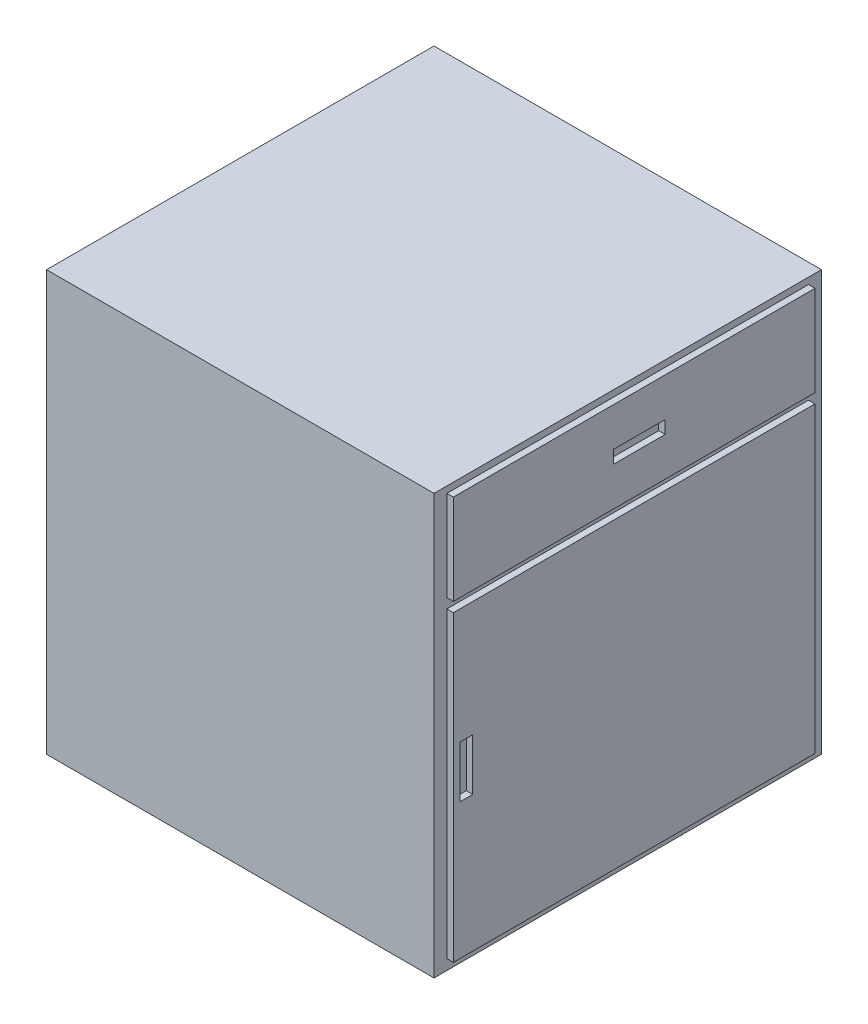
ISO-10303-21;
HEADER;
FILE_DESCRIPTION(('STEP AP214'),'2;1');
FILE_NAME('part.step','',(''),(''),'','','');
FILE_SCHEMA(('AUTOMOTIVE_DESIGN { 1 0 10303 214 1 1 1 1 }'));
ENDSEC;
DATA;
#1=APPLICATION_CONTEXT('core data for automotive mechanical design processes');
#2=APPLICATION_PROTOCOL_DEFINITION('international standard','automotive_design',2000,#1);
#3=PRODUCT_CONTEXT('',#1,'mechanical');
#4=PRODUCT('Part','Part','',(#3));
#5=PRODUCT_RELATED_PRODUCT_CATEGORY('part','',(#4));
#6=PRODUCT_DEFINITION_FORMATION('','',#4);
#7=PRODUCT_DEFINITION_CONTEXT('part definition',#1,'design');
#8=PRODUCT_DEFINITION('design','',#6,#7);
#9=PRODUCT_DEFINITION_SHAPE('','',#8);
#10=(LENGTH_UNIT() NAMED_UNIT(*) SI_UNIT(.MILLI.,.METRE.));
#11=(NAMED_UNIT(*) PLANE_ANGLE_UNIT() SI_UNIT($,.RADIAN.));
#12=(NAMED_UNIT(*) SI_UNIT($,.STERADIAN.) SOLID_ANGLE_UNIT());
#13=UNCERTAINTY_MEASURE_WITH_UNIT(LENGTH_MEASURE(1.E-05),#10,'distance_accuracy_value','');
#14=(GEOMETRIC_REPRESENTATION_CONTEXT(3) GLOBAL_UNCERTAINTY_ASSIGNED_CONTEXT((#13)) GLOBAL_UNIT_ASSIGNED_CONTEXT((#10,
#11,#12)) REPRESENTATION_CONTEXT('',''));
#15=CARTESIAN_POINT('',(0.,0.,0.));
#16=DIRECTION('',(0.,0.,1.));
#17=DIRECTION('',(1.,0.,0.));
#18=AXIS2_PLACEMENT_3D('',#15,#16,#17);
#19=CARTESIAN_POINT('',(0.,0.,600.));
#20=DIRECTION('',(-1.,0.,0.));
#21=DIRECTION('',(0.,-1.,0.));
#22=AXIS2_PLACEMENT_3D('',#19,#20,#21);
#23=PLANE('',#22);
#24=DIRECTION('',(0.,1.,0.));
#25=VECTOR('',#24,1.);
#26=CARTESIAN_POINT('',(0.,0.,0.));
#27=LINE('',#26,#25);
#28=CARTESIAN_POINT('',(0.,-650.,0.));
#29=VERTEX_POINT('',#28);
#30=CARTESIAN_POINT('',(0.,0.,0.));
#31=VERTEX_POINT('',#30);
#32=EDGE_CURVE('E304',#29,#31,#27,.T.);
#33=ORIENTED_EDGE('',*,*,#32,.T.);
#34=DIRECTION('',(0.,0.,-1.));
#35=VECTOR('',#34,1.);
#36=CARTESIAN_POINT('',(0.,0.,600.));
#37=LINE('',#36,#35);
#38=CARTESIAN_POINT('',(0.,0.,600.));
#39=VERTEX_POINT('',#38);
#40=EDGE_CURVE('E11',#39,#31,#37,.T.);
#41=ORIENTED_EDGE('',*,*,#40,.F.);
#42=DIRECTION('',(0.,1.,0.));
#43=VECTOR('',#42,1.);
#44=CARTESIAN_POINT('',(0.,0.,600.));
#45=LINE('',#44,#43);
#46=CARTESIAN_POINT('',(0.,-650.,600.));
#47=VERTEX_POINT('',#46);
#48=EDGE_CURVE('E305',#47,#39,#45,.T.);
#49=ORIENTED_EDGE('',*,*,#48,.F.);
#50=DIRECTION('',(0.,0.,-1.));
#51=VECTOR('',#50,1.);
#52=CARTESIAN_POINT('',(0.,-650.,600.));
#53=LINE('',#52,#51);
#54=EDGE_CURVE('E315',#47,#29,#53,.T.);
#55=ORIENTED_EDGE('',*,*,#54,.T.);
#56=EDGE_LOOP('',(#33,#41,#49,#55));
#57=FACE_BOUND('',#56,.T.);
#58=DIRECTION('',(0.,-1.,0.));
#59=VECTOR('',#58,1.);
#60=CARTESIAN_POINT('',(0.,-9.99660470248492,580.));
#61=LINE('',#60,#59);
#62=CARTESIAN_POINT('',(0.,-9.99660470248492,580.));
#63=VERTEX_POINT('',#62);
#64=CARTESIAN_POINT('',(0.,-149.996604702485,580.));
#65=VERTEX_POINT('',#64);
#66=EDGE_CURVE('E271',#63,#65,#61,.T.);
#67=ORIENTED_EDGE('',*,*,#66,.F.);
#68=DIRECTION('',(0.,0.,1.));
#69=VECTOR('',#68,1.);
#70=CARTESIAN_POINT('',(0.,-9.99660470248492,580.));
#71=LINE('',#70,#69);
#72=CARTESIAN_POINT('',(0.,-9.99660470248492,20.));
#73=VERTEX_POINT('',#72);
#74=EDGE_CURVE('E276',#73,#63,#71,.T.);
#75=ORIENTED_EDGE('',*,*,#74,.F.);
#76=DIRECTION('',(0.,1.,0.));
#77=VECTOR('',#76,1.);
#78=CARTESIAN_POINT('',(0.,-9.99660470248492,20.));
#79=LINE('',#78,#77);
#80=CARTESIAN_POINT('',(0.,-149.996604702485,20.));
#81=VERTEX_POINT('',#80);
#82=EDGE_CURVE('E288',#81,#73,#79,.T.);
#83=ORIENTED_EDGE('',*,*,#82,.F.);
#84=DIRECTION('',(0.,0.,-1.));
#85=VECTOR('',#84,1.);
#86=CARTESIAN_POINT('',(0.,-149.996604702485,580.));
#87=LINE('',#86,#85);
#88=EDGE_CURVE('E285',#65,#81,#87,.T.);
#89=ORIENTED_EDGE('',*,*,#88,.F.);
#90=EDGE_LOOP('',(#67,#75,#83,#89));
#91=FACE_BOUND('',#90,.T.);
#92=DIRECTION('',(0.,-1.,0.));
#93=VECTOR('',#92,1.);
#94=CARTESIAN_POINT('',(0.,-164.996604702485,580.));
#95=LINE('',#94,#93);
#96=CARTESIAN_POINT('',(0.,-164.996604702485,580.));
#97=VERTEX_POINT('',#96);
#98=CARTESIAN_POINT('',(0.,-633.972073677954,580.));
#99=VERTEX_POINT('',#98);
#100=EDGE_CURVE('E190',#97,#99,#95,.T.);
#101=ORIENTED_EDGE('',*,*,#100,.F.);
#102=DIRECTION('',(0.,0.,1.));
#103=VECTOR('',#102,1.);
#104=CARTESIAN_POINT('',(0.,-164.996604702485,580.));
#105=LINE('',#104,#103);
#106=CARTESIAN_POINT('',(0.,-164.996604702485,20.));
#107=VERTEX_POINT('',#106);
#108=EDGE_CURVE('E218',#107,#97,#105,.T.);
#109=ORIENTED_EDGE('',*,*,#108,.F.);
#110=DIRECTION('',(0.,1.,0.));
#111=VECTOR('',#110,1.);
#112=CARTESIAN_POINT('',(0.,-164.996604702485,20.));
#113=LINE('',#112,#111);
#114=CARTESIAN_POINT('',(0.,-633.972073677954,19.9999999999999));
#115=VERTEX_POINT('',#114);
#116=EDGE_CURVE('E56',#115,#107,#113,.T.);
#117=ORIENTED_EDGE('',*,*,#116,.F.);
#118=DIRECTION('',(0.,0.,-1.));
#119=VECTOR('',#118,1.);
#120=CARTESIAN_POINT('',(0.,-633.972073677954,580.));
#121=LINE('',#120,#119);
#122=EDGE_CURVE('E51',#99,#115,#121,.T.);
#123=ORIENTED_EDGE('',*,*,#122,.F.);
#124=EDGE_LOOP('',(#101,#109,#117,#123));
#125=FACE_BOUND('',#124,.T.);
#126=ADVANCED_FACE('F36',(#57,#91,#125),#23,.F.);
#127=CARTESIAN_POINT('',(0.,0.,600.));
#128=DIRECTION('',(0.,-1.,0.));
#129=DIRECTION('',(1.,0.,0.));
#130=AXIS2_PLACEMENT_3D('',#127,#128,#129);
#131=PLANE('',#130);
#132=DIRECTION('',(-1.,0.,0.));
#133=VECTOR('',#132,1.);
#134=CARTESIAN_POINT('',(0.,0.,0.));
#135=LINE('',#134,#133);
#136=CARTESIAN_POINT('',(-600.,0.,0.));
#137=VERTEX_POINT('',#136);
#138=EDGE_CURVE('E318',#31,#137,#135,.T.);
#139=ORIENTED_EDGE('',*,*,#138,.T.);
#140=DIRECTION('',(0.,0.,-1.));
#141=VECTOR('',#140,1.);
#142=CARTESIAN_POINT('',(-600.,0.,600.));
#143=LINE('',#142,#141);
#144=CARTESIAN_POINT('',(-600.,0.,600.));
#145=VERTEX_POINT('',#144);
#146=EDGE_CURVE('E44',#145,#137,#143,.T.);
#147=ORIENTED_EDGE('',*,*,#146,.F.);
#148=DIRECTION('',(-1.,0.,0.));
#149=VECTOR('',#148,1.);
#150=CARTESIAN_POINT('',(0.,0.,600.));
#151=LINE('',#150,#149);
#152=EDGE_CURVE('E308',#39,#145,#151,.T.);
#153=ORIENTED_EDGE('',*,*,#152,.F.);
#154=ORIENTED_EDGE('',*,*,#40,.T.);
#155=EDGE_LOOP('',(#139,#147,#153,#154));
#156=FACE_BOUND('',#155,.T.);
#157=ADVANCED_FACE('F349',(#156),#131,.F.);
#158=CARTESIAN_POINT('',(-600.,0.,600.));
#159=DIRECTION('',(1.,0.,0.));
#160=DIRECTION('',(0.,0.,-1.));
#161=AXIS2_PLACEMENT_3D('',#158,#159,#160);
#162=PLANE('',#161);
#163=DIRECTION('',(0.,-1.,0.));
#164=VECTOR('',#163,1.);
#165=CARTESIAN_POINT('',(-600.,0.,0.));
#166=LINE('',#165,#164);
#167=CARTESIAN_POINT('',(-600.,-650.,0.));
#168=VERTEX_POINT('',#167);
#169=EDGE_CURVE('E320',#137,#168,#166,.T.);
#170=ORIENTED_EDGE('',*,*,#169,.T.);
#171=DIRECTION('',(0.,0.,-1.));
#172=VECTOR('',#171,1.);
#173=CARTESIAN_POINT('',(-600.,-650.,600.));
#174=LINE('',#173,#172);
#175=CARTESIAN_POINT('',(-600.,-650.,600.));
#176=VERTEX_POINT('',#175);
#177=EDGE_CURVE('E325',#176,#168,#174,.T.);
#178=ORIENTED_EDGE('',*,*,#177,.F.);
#179=DIRECTION('',(0.,-1.,0.));
#180=VECTOR('',#179,1.);
#181=CARTESIAN_POINT('',(-600.,0.,600.));
#182=LINE('',#181,#180);
#183=EDGE_CURVE('E311',#145,#176,#182,.T.);
#184=ORIENTED_EDGE('',*,*,#183,.F.);
#185=ORIENTED_EDGE('',*,*,#146,.T.);
#186=EDGE_LOOP('',(#170,#178,#184,#185));
#187=FACE_BOUND('',#186,.T.);
#188=ADVANCED_FACE('F332',(#187),#162,.F.);
#189=CARTESIAN_POINT('',(0.,-650.,600.));
#190=DIRECTION('',(0.,1.,0.));
#191=DIRECTION('',(-1.,0.,0.));
#192=AXIS2_PLACEMENT_3D('',#189,#190,#191);
#193=PLANE('',#192);
#194=DIRECTION('',(1.,0.,0.));
#195=VECTOR('',#194,1.);
#196=CARTESIAN_POINT('',(0.,-650.,0.));
#197=LINE('',#196,#195);
#198=EDGE_CURVE('E309',#168,#29,#197,.T.);
#199=ORIENTED_EDGE('',*,*,#198,.T.);
#200=ORIENTED_EDGE('',*,*,#54,.F.);
#201=DIRECTION('',(1.,0.,0.));
#202=VECTOR('',#201,1.);
#203=CARTESIAN_POINT('',(0.,-650.,600.));
#204=LINE('',#203,#202);
#205=EDGE_CURVE('E313',#176,#47,#204,.T.);
#206=ORIENTED_EDGE('',*,*,#205,.F.);
#207=ORIENTED_EDGE('',*,*,#177,.T.);
#208=EDGE_LOOP('',(#199,#200,#206,#207));
#209=FACE_BOUND('',#208,.T.);
#210=ADVANCED_FACE('F341',(#209),#193,.F.);
#211=CARTESIAN_POINT('',(0.,0.,600.));
#212=DIRECTION('',(0.,0.,-1.));
#213=DIRECTION('',(-1.,0.,0.));
#214=AXIS2_PLACEMENT_3D('',#211,#212,#213);
#215=PLANE('',#214);
#216=ORIENTED_EDGE('',*,*,#48,.T.);
#217=ORIENTED_EDGE('',*,*,#152,.T.);
#218=ORIENTED_EDGE('',*,*,#183,.T.);
#219=ORIENTED_EDGE('',*,*,#205,.T.);
#220=EDGE_LOOP('',(#216,#217,#218,#219));
#221=FACE_BOUND('',#220,.T.);
#222=ADVANCED_FACE('F348',(#221),#215,.F.);
#223=CARTESIAN_POINT('',(0.,0.,0.));
#224=DIRECTION('',(0.,0.,-1.));
#225=DIRECTION('',(-1.,0.,0.));
#226=AXIS2_PLACEMENT_3D('',#223,#224,#225);
#227=PLANE('',#226);
#228=ORIENTED_EDGE('',*,*,#32,.F.);
#229=ORIENTED_EDGE('',*,*,#198,.F.);
#230=ORIENTED_EDGE('',*,*,#169,.F.);
#231=ORIENTED_EDGE('',*,*,#138,.F.);
#232=EDGE_LOOP('',(#228,#229,#230,#231));
#233=FACE_BOUND('',#232,.T.);
#234=ADVANCED_FACE('F338',(#233),#227,.T.);
#235=CARTESIAN_POINT('',(10.,0.,0.));
#236=DIRECTION('',(1.,0.,0.));
#237=DIRECTION('',(0.,1.,0.));
#238=AXIS2_PLACEMENT_3D('',#235,#236,#237);
#239=PLANE('',#238);
#240=DIRECTION('',(0.,-1.,0.));
#241=VECTOR('',#240,1.);
#242=CARTESIAN_POINT('',(10.,-9.99660470248492,580.));
#243=LINE('',#242,#241);
#244=CARTESIAN_POINT('',(10.,-9.99660470248492,580.));
#245=VERTEX_POINT('',#244);
#246=CARTESIAN_POINT('',(10.,-149.996604702485,580.));
#247=VERTEX_POINT('',#246);
#248=EDGE_CURVE('E272',#245,#247,#243,.T.);
#249=ORIENTED_EDGE('',*,*,#248,.T.);
#250=DIRECTION('',(0.,0.,-1.));
#251=VECTOR('',#250,1.);
#252=CARTESIAN_POINT('',(10.,-149.996604702485,580.));
#253=LINE('',#252,#251);
#254=CARTESIAN_POINT('',(10.,-149.996604702485,20.));
#255=VERTEX_POINT('',#254);
#256=EDGE_CURVE('E275',#247,#255,#253,.T.);
#257=ORIENTED_EDGE('',*,*,#256,.T.);
#258=DIRECTION('',(0.,1.,0.));
#259=VECTOR('',#258,1.);
#260=CARTESIAN_POINT('',(10.,-9.99660470248492,20.));
#261=LINE('',#260,#259);
#262=CARTESIAN_POINT('',(10.,-9.99660470248492,20.));
#263=VERTEX_POINT('',#262);
#264=EDGE_CURVE('E278',#255,#263,#261,.T.);
#265=ORIENTED_EDGE('',*,*,#264,.T.);
#266=DIRECTION('',(0.,0.,1.));
#267=VECTOR('',#266,1.);
#268=CARTESIAN_POINT('',(10.,-9.99660470248492,580.));
#269=LINE('',#268,#267);
#270=EDGE_CURVE('E280',#263,#245,#269,.T.);
#271=ORIENTED_EDGE('',*,*,#270,.T.);
#272=EDGE_LOOP('',(#249,#257,#265,#271));
#273=FACE_BOUND('',#272,.T.);
#274=DIRECTION('',(0.,0.,-1.));
#275=VECTOR('',#274,1.);
#276=CARTESIAN_POINT('',(10.,-89.9605296664098,332.));
#277=LINE('',#276,#275);
#278=CARTESIAN_POINT('',(10.,-89.9605296664098,332.));
#279=VERTEX_POINT('',#278);
#280=CARTESIAN_POINT('',(10.,-89.9605296664098,252.));
#281=VERTEX_POINT('',#280);
#282=EDGE_CURVE('E244',#279,#281,#277,.T.);
#283=ORIENTED_EDGE('',*,*,#282,.F.);
#284=DIRECTION('',(0.,-1.,0.));
#285=VECTOR('',#284,1.);
#286=CARTESIAN_POINT('',(10.,-69.9605296664098,332.));
#287=LINE('',#286,#285);
#288=CARTESIAN_POINT('',(10.,-69.9605296664098,332.));
#289=VERTEX_POINT('',#288);
#290=EDGE_CURVE('E242',#289,#279,#287,.T.);
#291=ORIENTED_EDGE('',*,*,#290,.F.);
#292=DIRECTION('',(0.,0.,1.));
#293=VECTOR('',#292,1.);
#294=CARTESIAN_POINT('',(10.,-69.9605296664098,332.));
#295=LINE('',#294,#293);
#296=CARTESIAN_POINT('',(10.,-69.9605296664098,252.));
#297=VERTEX_POINT('',#296);
#298=EDGE_CURVE('E250',#297,#289,#295,.T.);
#299=ORIENTED_EDGE('',*,*,#298,.F.);
#300=DIRECTION('',(0.,1.,0.));
#301=VECTOR('',#300,1.);
#302=CARTESIAN_POINT('',(10.,-69.9605296664098,252.));
#303=LINE('',#302,#301);
#304=EDGE_CURVE('E247',#281,#297,#303,.T.);
#305=ORIENTED_EDGE('',*,*,#304,.F.);
#306=EDGE_LOOP('',(#283,#291,#299,#305));
#307=FACE_BOUND('',#306,.T.);
#308=ADVANCED_FACE('F362',(#273,#307),#239,.T.);
#309=CARTESIAN_POINT('',(10.,-9.99660470248492,580.));
#310=DIRECTION('',(0.,0.,-1.));
#311=DIRECTION('',(0.,1.,0.));
#312=AXIS2_PLACEMENT_3D('',#309,#310,#311);
#313=PLANE('',#312);
#314=ORIENTED_EDGE('',*,*,#66,.T.);
#315=DIRECTION('',(-1.,0.,0.));
#316=VECTOR('',#315,1.);
#317=CARTESIAN_POINT('',(10.,-149.996604702485,580.));
#318=LINE('',#317,#316);
#319=EDGE_CURVE('E301',#247,#65,#318,.T.);
#320=ORIENTED_EDGE('',*,*,#319,.F.);
#321=ORIENTED_EDGE('',*,*,#248,.F.);
#322=DIRECTION('',(-1.,0.,0.));
#323=VECTOR('',#322,1.);
#324=CARTESIAN_POINT('',(10.,-9.99660470248492,580.));
#325=LINE('',#324,#323);
#326=EDGE_CURVE('E282',#245,#63,#325,.T.);
#327=ORIENTED_EDGE('',*,*,#326,.T.);
#328=EDGE_LOOP('',(#314,#320,#321,#327));
#329=FACE_BOUND('',#328,.T.);
#330=ADVANCED_FACE('F365',(#329),#313,.F.);
#331=CARTESIAN_POINT('',(10.,-149.996604702485,580.));
#332=DIRECTION('',(0.,1.,0.));
#333=DIRECTION('',(-1.,0.,0.));
#334=AXIS2_PLACEMENT_3D('',#331,#332,#333);
#335=PLANE('',#334);
#336=ORIENTED_EDGE('',*,*,#88,.T.);
#337=DIRECTION('',(-1.,0.,0.));
#338=VECTOR('',#337,1.);
#339=CARTESIAN_POINT('',(10.,-149.996604702485,20.));
#340=LINE('',#339,#338);
#341=EDGE_CURVE('E298',#255,#81,#340,.T.);
#342=ORIENTED_EDGE('',*,*,#341,.F.);
#343=ORIENTED_EDGE('',*,*,#256,.F.);
#344=ORIENTED_EDGE('',*,*,#319,.T.);
#345=EDGE_LOOP('',(#336,#342,#343,#344));
#346=FACE_BOUND('',#345,.T.);
#347=ADVANCED_FACE('F368',(#346),#335,.F.);
#348=CARTESIAN_POINT('',(10.,-9.99660470248492,20.));
#349=DIRECTION('',(0.,0.,1.));
#350=DIRECTION('',(1.,0.,0.));
#351=AXIS2_PLACEMENT_3D('',#348,#349,#350);
#352=PLANE('',#351);
#353=ORIENTED_EDGE('',*,*,#82,.T.);
#354=DIRECTION('',(-1.,0.,0.));
#355=VECTOR('',#354,1.);
#356=CARTESIAN_POINT('',(10.,-9.99660470248492,20.));
#357=LINE('',#356,#355);
#358=EDGE_CURVE('E295',#263,#73,#357,.T.);
#359=ORIENTED_EDGE('',*,*,#358,.F.);
#360=ORIENTED_EDGE('',*,*,#264,.F.);
#361=ORIENTED_EDGE('',*,*,#341,.T.);
#362=EDGE_LOOP('',(#353,#359,#360,#361));
#363=FACE_BOUND('',#362,.T.);
#364=ADVANCED_FACE('F372',(#363),#352,.F.);
#365=CARTESIAN_POINT('',(10.,-9.99660470248492,580.));
#366=DIRECTION('',(0.,-1.,0.));
#367=DIRECTION('',(1.,0.,0.));
#368=AXIS2_PLACEMENT_3D('',#365,#366,#367);
#369=PLANE('',#368);
#370=ORIENTED_EDGE('',*,*,#74,.T.);
#371=ORIENTED_EDGE('',*,*,#326,.F.);
#372=ORIENTED_EDGE('',*,*,#270,.F.);
#373=ORIENTED_EDGE('',*,*,#358,.T.);
#374=EDGE_LOOP('',(#370,#371,#372,#373));
#375=FACE_BOUND('',#374,.T.);
#376=ADVANCED_FACE('F376',(#375),#369,.F.);
#377=CARTESIAN_POINT('',(10.,-69.9605296664098,332.));
#378=DIRECTION('',(0.,0.,-1.));
#379=DIRECTION('',(-1.,0.,0.));
#380=AXIS2_PLACEMENT_3D('',#377,#378,#379);
#381=PLANE('',#380);
#382=DIRECTION('',(0.,-1.,0.));
#383=VECTOR('',#382,1.);
#384=CARTESIAN_POINT('',(0.,-69.9605296664098,332.));
#385=LINE('',#384,#383);
#386=CARTESIAN_POINT('',(0.,-69.9605296664098,332.));
#387=VERTEX_POINT('',#386);
#388=CARTESIAN_POINT('',(0.,-89.9605296664098,332.));
#389=VERTEX_POINT('',#388);
#390=EDGE_CURVE('E241',#387,#389,#385,.T.);
#391=ORIENTED_EDGE('',*,*,#390,.F.);
#392=DIRECTION('',(-1.,0.,0.));
#393=VECTOR('',#392,1.);
#394=CARTESIAN_POINT('',(10.,-69.9605296664098,332.));
#395=LINE('',#394,#393);
#396=EDGE_CURVE('E252',#289,#387,#395,.T.);
#397=ORIENTED_EDGE('',*,*,#396,.F.);
#398=ORIENTED_EDGE('',*,*,#290,.T.);
#399=DIRECTION('',(-1.,0.,0.));
#400=VECTOR('',#399,1.);
#401=CARTESIAN_POINT('',(10.,-89.9605296664098,332.));
#402=LINE('',#401,#400);
#403=EDGE_CURVE('E268',#279,#389,#402,.T.);
#404=ORIENTED_EDGE('',*,*,#403,.T.);
#405=EDGE_LOOP('',(#391,#397,#398,#404));
#406=FACE_BOUND('',#405,.T.);
#407=ADVANCED_FACE('F380',(#406),#381,.T.);
#408=CARTESIAN_POINT('',(10.,-89.9605296664098,332.));
#409=DIRECTION('',(0.,1.,0.));
#410=DIRECTION('',(-1.,0.,0.));
#411=AXIS2_PLACEMENT_3D('',#408,#409,#410);
#412=PLANE('',#411);
#413=DIRECTION('',(0.,0.,-1.));
#414=VECTOR('',#413,1.);
#415=CARTESIAN_POINT('',(0.,-89.9605296664098,332.));
#416=LINE('',#415,#414);
#417=CARTESIAN_POINT('',(0.,-89.9605296664098,252.));
#418=VERTEX_POINT('',#417);
#419=EDGE_CURVE('E255',#389,#418,#416,.T.);
#420=ORIENTED_EDGE('',*,*,#419,.F.);
#421=ORIENTED_EDGE('',*,*,#403,.F.);
#422=ORIENTED_EDGE('',*,*,#282,.T.);
#423=DIRECTION('',(-1.,0.,0.));
#424=VECTOR('',#423,1.);
#425=CARTESIAN_POINT('',(10.,-89.9605296664098,252.));
#426=LINE('',#425,#424);
#427=EDGE_CURVE('E266',#281,#418,#426,.T.);
#428=ORIENTED_EDGE('',*,*,#427,.T.);
#429=EDGE_LOOP('',(#420,#421,#422,#428));
#430=FACE_BOUND('',#429,.T.);
#431=ADVANCED_FACE('F387',(#430),#412,.T.);
#432=CARTESIAN_POINT('',(10.,-69.9605296664098,252.));
#433=DIRECTION('',(0.,0.,1.));
#434=DIRECTION('',(1.,0.,0.));
#435=AXIS2_PLACEMENT_3D('',#432,#433,#434);
#436=PLANE('',#435);
#437=DIRECTION('',(0.,1.,0.));
#438=VECTOR('',#437,1.);
#439=CARTESIAN_POINT('',(0.,-69.9605296664098,252.));
#440=LINE('',#439,#438);
#441=CARTESIAN_POINT('',(0.,-69.9605296664098,252.));
#442=VERTEX_POINT('',#441);
#443=EDGE_CURVE('E258',#418,#442,#440,.T.);
#444=ORIENTED_EDGE('',*,*,#443,.F.);
#445=ORIENTED_EDGE('',*,*,#427,.F.);
#446=ORIENTED_EDGE('',*,*,#304,.T.);
#447=DIRECTION('',(-1.,0.,0.));
#448=VECTOR('',#447,1.);
#449=CARTESIAN_POINT('',(10.,-69.9605296664098,252.));
#450=LINE('',#449,#448);
#451=EDGE_CURVE('E264',#297,#442,#450,.T.);
#452=ORIENTED_EDGE('',*,*,#451,.T.);
#453=EDGE_LOOP('',(#444,#445,#446,#452));
#454=FACE_BOUND('',#453,.T.);
#455=ADVANCED_FACE('F391',(#454),#436,.T.);
#456=CARTESIAN_POINT('',(10.,-69.9605296664098,332.));
#457=DIRECTION('',(0.,-1.,0.));
#458=DIRECTION('',(1.,0.,0.));
#459=AXIS2_PLACEMENT_3D('',#456,#457,#458);
#460=PLANE('',#459);
#461=DIRECTION('',(0.,0.,1.));
#462=VECTOR('',#461,1.);
#463=CARTESIAN_POINT('',(0.,-69.9605296664098,332.));
#464=LINE('',#463,#462);
#465=EDGE_CURVE('E245',#442,#387,#464,.T.);
#466=ORIENTED_EDGE('',*,*,#465,.F.);
#467=ORIENTED_EDGE('',*,*,#451,.F.);
#468=ORIENTED_EDGE('',*,*,#298,.T.);
#469=ORIENTED_EDGE('',*,*,#396,.T.);
#470=EDGE_LOOP('',(#466,#467,#468,#469));
#471=FACE_BOUND('',#470,.T.);
#472=ADVANCED_FACE('F395',(#471),#460,.T.);
#473=ORIENTED_EDGE('',*,*,#465,.T.);
#474=ORIENTED_EDGE('',*,*,#390,.T.);
#475=ORIENTED_EDGE('',*,*,#419,.T.);
#476=ORIENTED_EDGE('',*,*,#443,.T.);
#477=EDGE_LOOP('',(#473,#474,#475,#476));
#478=FACE_BOUND('',#477,.T.);
#479=ADVANCED_FACE('F38',(#478),#23,.F.);
#480=CARTESIAN_POINT('',(10.,0.,0.));
#481=DIRECTION('',(1.,0.,0.));
#482=DIRECTION('',(0.,1.,0.));
#483=AXIS2_PLACEMENT_3D('',#480,#481,#482);
#484=PLANE('',#483);
#485=DIRECTION('',(0.,-1.,0.));
#486=VECTOR('',#485,1.);
#487=CARTESIAN_POINT('',(10.,-164.996604702485,580.));
#488=LINE('',#487,#486);
#489=CARTESIAN_POINT('',(10.,-164.996604702485,580.));
#490=VERTEX_POINT('',#489);
#491=CARTESIAN_POINT('',(10.0000000000001,-633.972073677954,580.));
#492=VERTEX_POINT('',#491);
#493=EDGE_CURVE('E214',#490,#492,#488,.T.);
#494=ORIENTED_EDGE('',*,*,#493,.T.);
#495=DIRECTION('',(0.,0.,-1.));
#496=VECTOR('',#495,1.);
#497=CARTESIAN_POINT('',(10.0000000000001,-633.972073677954,580.));
#498=LINE('',#497,#496);
#499=CARTESIAN_POINT('',(10.0000000000001,-633.972073677954,19.9999999999999));
#500=VERTEX_POINT('',#499);
#501=EDGE_CURVE('E217',#492,#500,#498,.T.);
#502=ORIENTED_EDGE('',*,*,#501,.T.);
#503=DIRECTION('',(0.,1.,0.));
#504=VECTOR('',#503,1.);
#505=CARTESIAN_POINT('',(10.,-164.996604702485,20.));
#506=LINE('',#505,#504);
#507=CARTESIAN_POINT('',(10.,-164.996604702485,20.));
#508=VERTEX_POINT('',#507);
#509=EDGE_CURVE('E220',#500,#508,#506,.T.);
#510=ORIENTED_EDGE('',*,*,#509,.T.);
#511=DIRECTION('',(0.,0.,1.));
#512=VECTOR('',#511,1.);
#513=CARTESIAN_POINT('',(10.,-164.996604702485,580.));
#514=LINE('',#513,#512);
#515=EDGE_CURVE('E222',#508,#490,#514,.T.);
#516=ORIENTED_EDGE('',*,*,#515,.T.);
#517=EDGE_LOOP('',(#494,#502,#510,#516));
#518=FACE_BOUND('',#517,.T.);
#519=DIRECTION('',(0.,0.,-1.));
#520=VECTOR('',#519,1.);
#521=CARTESIAN_POINT('',(10.0000000000001,-423.759018759017,570.));
#522=LINE('',#521,#520);
#523=CARTESIAN_POINT('',(10.0000000000001,-423.759018759017,570.));
#524=VERTEX_POINT('',#523);
#525=CARTESIAN_POINT('',(10.0000000000001,-423.759018759017,550.));
#526=VERTEX_POINT('',#525);
#527=EDGE_CURVE('E182',#524,#526,#522,.T.);
#528=ORIENTED_EDGE('',*,*,#527,.F.);
#529=DIRECTION('',(0.,-1.,0.));
#530=VECTOR('',#529,1.);
#531=CARTESIAN_POINT('',(10.,-343.759018759017,570.));
#532=LINE('',#531,#530);
#533=CARTESIAN_POINT('',(10.,-343.759018759017,570.));
#534=VERTEX_POINT('',#533);
#535=EDGE_CURVE('E172',#534,#524,#532,.T.);
#536=ORIENTED_EDGE('',*,*,#535,.F.);
#537=DIRECTION('',(0.,0.,1.));
#538=VECTOR('',#537,1.);
#539=CARTESIAN_POINT('',(10.,-343.759018759017,570.));
#540=LINE('',#539,#538);
#541=CARTESIAN_POINT('',(10.,-343.759018759017,550.));
#542=VERTEX_POINT('',#541);
#543=EDGE_CURVE('E198',#542,#534,#540,.T.);
#544=ORIENTED_EDGE('',*,*,#543,.F.);
#545=DIRECTION('',(0.,1.,0.));
#546=VECTOR('',#545,1.);
#547=CARTESIAN_POINT('',(10.,-343.759018759017,550.));
#548=LINE('',#547,#546);
#549=EDGE_CURVE('E196',#526,#542,#548,.T.);
#550=ORIENTED_EDGE('',*,*,#549,.F.);
#551=EDGE_LOOP('',(#528,#536,#544,#550));
#552=FACE_BOUND('',#551,.T.);
#553=ADVANCED_FACE('F194',(#518,#552),#484,.T.);
#554=CARTESIAN_POINT('',(10.,-164.996604702485,580.));
#555=DIRECTION('',(0.,0.,-1.));
#556=DIRECTION('',(-1.,0.,0.));
#557=AXIS2_PLACEMENT_3D('',#554,#555,#556);
#558=PLANE('',#557);
#559=ORIENTED_EDGE('',*,*,#100,.T.);
#560=DIRECTION('',(-1.,0.,0.));
#561=VECTOR('',#560,1.);
#562=CARTESIAN_POINT('',(10.0000000000001,-633.972073677954,580.));
#563=LINE('',#562,#561);
#564=EDGE_CURVE('E239',#492,#99,#563,.T.);
#565=ORIENTED_EDGE('',*,*,#564,.F.);
#566=ORIENTED_EDGE('',*,*,#493,.F.);
#567=DIRECTION('',(-1.,0.,0.));
#568=VECTOR('',#567,1.);
#569=CARTESIAN_POINT('',(10.,-164.996604702485,580.));
#570=LINE('',#569,#568);
#571=EDGE_CURVE('E224',#490,#97,#570,.T.);
#572=ORIENTED_EDGE('',*,*,#571,.T.);
#573=EDGE_LOOP('',(#559,#565,#566,#572));
#574=FACE_BOUND('',#573,.T.);
#575=ADVANCED_FACE('F400',(#574),#558,.F.);
#576=CARTESIAN_POINT('',(10.0000000000001,-633.972073677954,580.));
#577=DIRECTION('',(0.,1.,0.));
#578=DIRECTION('',(-1.,0.,0.));
#579=AXIS2_PLACEMENT_3D('',#576,#577,#578);
#580=PLANE('',#579);
#581=ORIENTED_EDGE('',*,*,#122,.T.);
#582=DIRECTION('',(-1.,0.,0.));
#583=VECTOR('',#582,1.);
#584=CARTESIAN_POINT('',(10.0000000000001,-633.972073677954,19.9999999999999));
#585=LINE('',#584,#583);
#586=EDGE_CURVE('E236',#500,#115,#585,.T.);
#587=ORIENTED_EDGE('',*,*,#586,.F.);
#588=ORIENTED_EDGE('',*,*,#501,.F.);
#589=ORIENTED_EDGE('',*,*,#564,.T.);
#590=EDGE_LOOP('',(#581,#587,#588,#589));
#591=FACE_BOUND('',#590,.T.);
#592=ADVANCED_FACE('F403',(#591),#580,.F.);
#593=CARTESIAN_POINT('',(10.,-164.996604702485,20.));
#594=DIRECTION('',(0.,0.,1.));
#595=DIRECTION('',(0.,-1.,0.));
#596=AXIS2_PLACEMENT_3D('',#593,#594,#595);
#597=PLANE('',#596);
#598=ORIENTED_EDGE('',*,*,#116,.T.);
#599=DIRECTION('',(-1.,0.,0.));
#600=VECTOR('',#599,1.);
#601=CARTESIAN_POINT('',(10.,-164.996604702485,20.));
#602=LINE('',#601,#600);
#603=EDGE_CURVE('E233',#508,#107,#602,.T.);
#604=ORIENTED_EDGE('',*,*,#603,.F.);
#605=ORIENTED_EDGE('',*,*,#509,.F.);
#606=ORIENTED_EDGE('',*,*,#586,.T.);
#607=EDGE_LOOP('',(#598,#604,#605,#606));
#608=FACE_BOUND('',#607,.T.);
#609=ADVANCED_FACE('F407',(#608),#597,.F.);
#610=CARTESIAN_POINT('',(10.,-164.996604702485,580.));
#611=DIRECTION('',(0.,-1.,0.));
#612=DIRECTION('',(1.,0.,0.));
#613=AXIS2_PLACEMENT_3D('',#610,#611,#612);
#614=PLANE('',#613);
#615=ORIENTED_EDGE('',*,*,#108,.T.);
#616=ORIENTED_EDGE('',*,*,#571,.F.);
#617=ORIENTED_EDGE('',*,*,#515,.F.);
#618=ORIENTED_EDGE('',*,*,#603,.T.);
#619=EDGE_LOOP('',(#615,#616,#617,#618));
#620=FACE_BOUND('',#619,.T.);
#621=ADVANCED_FACE('F411',(#620),#614,.F.);
#622=CARTESIAN_POINT('',(10.,-343.759018759017,570.));
#623=DIRECTION('',(0.,0.,-1.));
#624=DIRECTION('',(-1.,0.,0.));
#625=AXIS2_PLACEMENT_3D('',#622,#623,#624);
#626=PLANE('',#625);
#627=DIRECTION('',(0.,-1.,0.));
#628=VECTOR('',#627,1.);
#629=CARTESIAN_POINT('',(0.,-343.759018759017,570.));
#630=LINE('',#629,#628);
#631=CARTESIAN_POINT('',(0.,-343.759018759017,570.));
#632=VERTEX_POINT('',#631);
#633=CARTESIAN_POINT('',(0.,-423.759018759017,570.));
#634=VERTEX_POINT('',#633);
#635=EDGE_CURVE('E202',#632,#634,#630,.T.);
#636=ORIENTED_EDGE('',*,*,#635,.F.);
#637=DIRECTION('',(-1.,0.,0.));
#638=VECTOR('',#637,1.);
#639=CARTESIAN_POINT('',(10.,-343.759018759017,570.));
#640=LINE('',#639,#638);
#641=EDGE_CURVE('E178',#534,#632,#640,.T.);
#642=ORIENTED_EDGE('',*,*,#641,.F.);
#643=ORIENTED_EDGE('',*,*,#535,.T.);
#644=DIRECTION('',(-1.,0.,0.));
#645=VECTOR('',#644,1.);
#646=CARTESIAN_POINT('',(10.0000000000001,-423.759018759017,570.));
#647=LINE('',#646,#645);
#648=EDGE_CURVE('E176',#524,#634,#647,.T.);
#649=ORIENTED_EDGE('',*,*,#648,.T.);
#650=EDGE_LOOP('',(#636,#642,#643,#649));
#651=FACE_BOUND('',#650,.T.);
#652=ADVANCED_FACE('F175',(#651),#626,.T.);
#653=CARTESIAN_POINT('',(10.0000000000001,-423.759018759017,570.));
#654=DIRECTION('',(0.,1.,0.));
#655=DIRECTION('',(-1.,0.,0.));
#656=AXIS2_PLACEMENT_3D('',#653,#654,#655);
#657=PLANE('',#656);
#658=DIRECTION('',(0.,0.,-1.));
#659=VECTOR('',#658,1.);
#660=CARTESIAN_POINT('',(0.,-423.759018759017,570.));
#661=LINE('',#660,#659);
#662=CARTESIAN_POINT('',(0.,-423.759018759017,550.));
#663=VERTEX_POINT('',#662);
#664=EDGE_CURVE('E189',#634,#663,#661,.T.);
#665=ORIENTED_EDGE('',*,*,#664,.F.);
#666=ORIENTED_EDGE('',*,*,#648,.F.);
#667=ORIENTED_EDGE('',*,*,#527,.T.);
#668=DIRECTION('',(-1.,0.,0.));
#669=VECTOR('',#668,1.);
#670=CARTESIAN_POINT('',(10.0000000000001,-423.759018759017,550.));
#671=LINE('',#670,#669);
#672=EDGE_CURVE('E191',#526,#663,#671,.T.);
#673=ORIENTED_EDGE('',*,*,#672,.T.);
#674=EDGE_LOOP('',(#665,#666,#667,#673));
#675=FACE_BOUND('',#674,.T.);
#676=ADVANCED_FACE('F186',(#675),#657,.T.);
#677=CARTESIAN_POINT('',(10.,-343.759018759017,550.));
#678=DIRECTION('',(0.,0.,1.));
#679=DIRECTION('',(0.,-1.,0.));
#680=AXIS2_PLACEMENT_3D('',#677,#678,#679);
#681=PLANE('',#680);
#682=DIRECTION('',(0.,1.,0.));
#683=VECTOR('',#682,1.);
#684=CARTESIAN_POINT('',(0.,-343.759018759017,550.));
#685=LINE('',#684,#683);
#686=CARTESIAN_POINT('',(0.,-343.759018759017,550.));
#687=VERTEX_POINT('',#686);
#688=EDGE_CURVE('E205',#663,#687,#685,.T.);
#689=ORIENTED_EDGE('',*,*,#688,.F.);
#690=ORIENTED_EDGE('',*,*,#672,.F.);
#691=ORIENTED_EDGE('',*,*,#549,.T.);
#692=DIRECTION('',(-1.,0.,0.));
#693=VECTOR('',#692,1.);
#694=CARTESIAN_POINT('',(10.,-343.759018759017,550.));
#695=LINE('',#694,#693);
#696=EDGE_CURVE('E211',#542,#687,#695,.T.);
#697=ORIENTED_EDGE('',*,*,#696,.T.);
#698=EDGE_LOOP('',(#689,#690,#691,#697));
#699=FACE_BOUND('',#698,.T.);
#700=ADVANCED_FACE('F423',(#699),#681,.T.);
#701=CARTESIAN_POINT('',(10.,-343.759018759017,570.));
#702=DIRECTION('',(0.,-1.,0.));
#703=DIRECTION('',(0.,0.,-1.));
#704=AXIS2_PLACEMENT_3D('',#701,#702,#703);
#705=PLANE('',#704);
#706=DIRECTION('',(0.,0.,1.));
#707=VECTOR('',#706,1.);
#708=CARTESIAN_POINT('',(0.,-343.759018759017,570.));
#709=LINE('',#708,#707);
#710=EDGE_CURVE('E183',#687,#632,#709,.T.);
#711=ORIENTED_EDGE('',*,*,#710,.F.);
#712=ORIENTED_EDGE('',*,*,#696,.F.);
#713=ORIENTED_EDGE('',*,*,#543,.T.);
#714=ORIENTED_EDGE('',*,*,#641,.T.);
#715=EDGE_LOOP('',(#711,#712,#713,#714));
#716=FACE_BOUND('',#715,.T.);
#717=ADVANCED_FACE('F426',(#716),#705,.T.);
#718=ORIENTED_EDGE('',*,*,#710,.T.);
#719=ORIENTED_EDGE('',*,*,#635,.T.);
#720=ORIENTED_EDGE('',*,*,#664,.T.);
#721=ORIENTED_EDGE('',*,*,#688,.T.);
#722=EDGE_LOOP('',(#718,#719,#720,#721));
#723=FACE_BOUND('',#722,.T.);
#724=ADVANCED_FACE('F356',(#723),#23,.F.);
#725=CLOSED_SHELL('',(#126,#157,#188,#210,#222,#234,#308,#330,#347,#364,#376,#407,#431,#455,
#472,#479,#553,#575,#592,#609,#621,#652,#676,#700,#717,#724));
#726=MANIFOLD_SOLID_BREP('B2',#725);
#727=ADVANCED_BREP_SHAPE_REPRESENTATION('',(#18,#726),#14);
#728=SHAPE_DEFINITION_REPRESENTATION(#9,#727);
ENDSEC;
END-ISO-10303-21;
